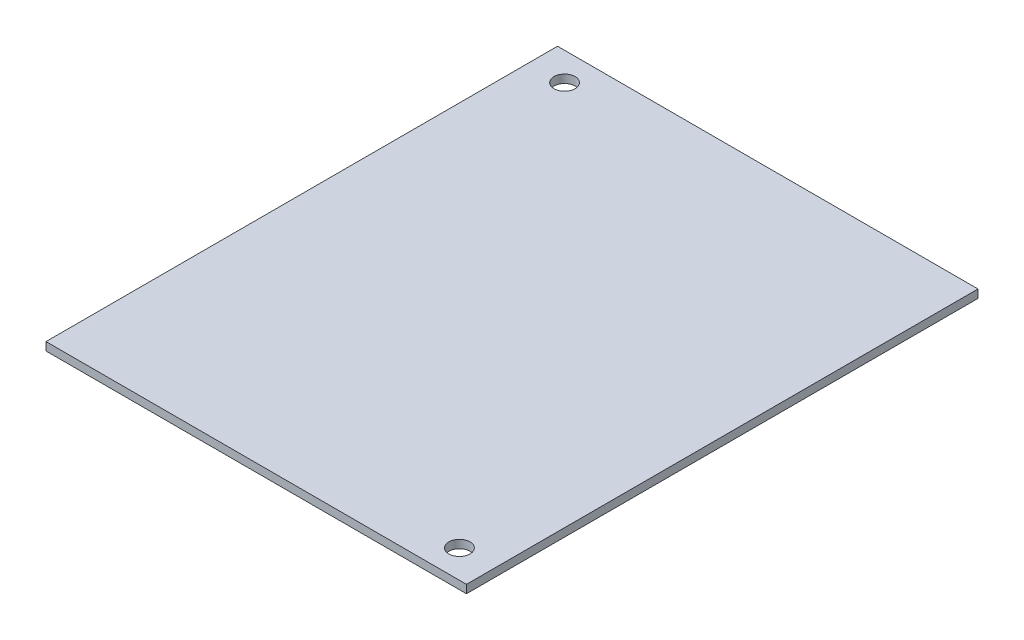
ISO-10303-21;
HEADER;
FILE_DESCRIPTION(('STEP AP214'),'2;1');
FILE_NAME('part.step','',(''),(''),'','','');
FILE_SCHEMA(('AUTOMOTIVE_DESIGN { 1 0 10303 214 1 1 1 1 }'));
ENDSEC;
DATA;
#1=APPLICATION_CONTEXT('core data for automotive mechanical design processes');
#2=APPLICATION_PROTOCOL_DEFINITION('international standard','automotive_design',2000,#1);
#3=PRODUCT_CONTEXT('',#1,'mechanical');
#4=PRODUCT('Part','Part','',(#3));
#5=PRODUCT_RELATED_PRODUCT_CATEGORY('part','',(#4));
#6=PRODUCT_DEFINITION_FORMATION('','',#4);
#7=PRODUCT_DEFINITION_CONTEXT('part definition',#1,'design');
#8=PRODUCT_DEFINITION('design','',#6,#7);
#9=PRODUCT_DEFINITION_SHAPE('','',#8);
#10=(LENGTH_UNIT() NAMED_UNIT(*) SI_UNIT(.MILLI.,.METRE.));
#11=(NAMED_UNIT(*) PLANE_ANGLE_UNIT() SI_UNIT($,.RADIAN.));
#12=(NAMED_UNIT(*) SI_UNIT($,.STERADIAN.) SOLID_ANGLE_UNIT());
#13=UNCERTAINTY_MEASURE_WITH_UNIT(LENGTH_MEASURE(1.E-05),#10,'distance_accuracy_value','');
#14=(GEOMETRIC_REPRESENTATION_CONTEXT(3) GLOBAL_UNCERTAINTY_ASSIGNED_CONTEXT((#13)) GLOBAL_UNIT_ASSIGNED_CONTEXT((#10,
#11,#12)) REPRESENTATION_CONTEXT('',''));
#15=CARTESIAN_POINT('',(0.,0.,0.));
#16=DIRECTION('',(0.,0.,1.));
#17=DIRECTION('',(1.,0.,0.));
#18=AXIS2_PLACEMENT_3D('',#15,#16,#17);
#19=CARTESIAN_POINT('',(0.,1.17,0.));
#20=DIRECTION('',(0.,1.,0.));
#21=DIRECTION('',(0.,0.,1.));
#22=AXIS2_PLACEMENT_3D('',#19,#20,#21);
#23=PLANE('',#22);
#24=CARTESIAN_POINT('',(25.,1.17,32.5));
#25=DIRECTION('',(0.,1.,0.));
#26=DIRECTION('',(0.,0.,1.));
#27=AXIS2_PLACEMENT_3D('',#24,#25,#26);
#28=CIRCLE('',#27,1.5025);
#29=CARTESIAN_POINT('',(25.,1.17,34.0025));
#30=VERTEX_POINT('',#29);
#31=EDGE_CURVE('E101',#30,#30,#28,.T.);
#32=ORIENTED_EDGE('',*,*,#31,.F.);
#33=EDGE_LOOP('',(#32));
#34=FACE_BOUND('',#33,.T.);
#35=DIRECTION('',(0.,0.,1.));
#36=VECTOR('',#35,1.);
#37=CARTESIAN_POINT('',(-30.,1.17,-36.5));
#38=LINE('',#37,#36);
#39=CARTESIAN_POINT('',(-30.,1.17,-36.5));
#40=VERTEX_POINT('',#39);
#41=CARTESIAN_POINT('',(-30.,1.17,36.5));
#42=VERTEX_POINT('',#41);
#43=EDGE_CURVE('E86',#40,#42,#38,.T.);
#44=ORIENTED_EDGE('',*,*,#43,.T.);
#45=DIRECTION('',(1.,0.,0.));
#46=VECTOR('',#45,1.);
#47=CARTESIAN_POINT('',(-30.,1.17,36.5));
#48=LINE('',#47,#46);
#49=CARTESIAN_POINT('',(30.,1.17,36.5));
#50=VERTEX_POINT('',#49);
#51=EDGE_CURVE('E81',#42,#50,#48,.T.);
#52=ORIENTED_EDGE('',*,*,#51,.T.);
#53=DIRECTION('',(0.,0.,-1.));
#54=VECTOR('',#53,1.);
#55=CARTESIAN_POINT('',(30.,1.17,-36.5));
#56=LINE('',#55,#54);
#57=CARTESIAN_POINT('',(30.,1.17,-36.5));
#58=VERTEX_POINT('',#57);
#59=EDGE_CURVE('E84',#50,#58,#56,.T.);
#60=ORIENTED_EDGE('',*,*,#59,.T.);
#61=DIRECTION('',(-1.,0.,0.));
#62=VECTOR('',#61,1.);
#63=CARTESIAN_POINT('',(-30.,1.17,-36.5));
#64=LINE('',#63,#62);
#65=EDGE_CURVE('E51',#58,#40,#64,.T.);
#66=ORIENTED_EDGE('',*,*,#65,.T.);
#67=EDGE_LOOP('',(#44,#52,#60,#66));
#68=FACE_BOUND('',#67,.T.);
#69=CARTESIAN_POINT('',(-25.,1.17,-32.5));
#70=DIRECTION('',(0.,1.,0.));
#71=DIRECTION('',(0.,0.,1.));
#72=AXIS2_PLACEMENT_3D('',#69,#70,#71);
#73=CIRCLE('',#72,1.5025);
#74=CARTESIAN_POINT('',(-25.,1.17,-30.9975));
#75=VERTEX_POINT('',#74);
#76=EDGE_CURVE('E116',#75,#75,#73,.T.);
#77=ORIENTED_EDGE('',*,*,#76,.F.);
#78=EDGE_LOOP('',(#77));
#79=FACE_BOUND('',#78,.T.);
#80=ADVANCED_FACE('F34',(#34,#68,#79),#23,.T.);
#81=CARTESIAN_POINT('',(0.,0.,0.));
#82=DIRECTION('',(0.,1.,0.));
#83=DIRECTION('',(0.,0.,1.));
#84=AXIS2_PLACEMENT_3D('',#81,#82,#83);
#85=PLANE('',#84);
#86=DIRECTION('',(0.,0.,1.));
#87=VECTOR('',#86,1.);
#88=CARTESIAN_POINT('',(-30.,0.,-36.5));
#89=LINE('',#88,#87);
#90=CARTESIAN_POINT('',(-30.,0.,-36.5));
#91=VERTEX_POINT('',#90);
#92=CARTESIAN_POINT('',(-30.,0.,36.5));
#93=VERTEX_POINT('',#92);
#94=EDGE_CURVE('E98',#91,#93,#89,.T.);
#95=ORIENTED_EDGE('',*,*,#94,.F.);
#96=DIRECTION('',(-1.,0.,0.));
#97=VECTOR('',#96,1.);
#98=CARTESIAN_POINT('',(-30.,0.,-36.5));
#99=LINE('',#98,#97);
#100=CARTESIAN_POINT('',(30.,0.,-36.5));
#101=VERTEX_POINT('',#100);
#102=EDGE_CURVE('E74',#101,#91,#99,.T.);
#103=ORIENTED_EDGE('',*,*,#102,.F.);
#104=DIRECTION('',(0.,0.,-1.));
#105=VECTOR('',#104,1.);
#106=CARTESIAN_POINT('',(30.,0.,-36.5));
#107=LINE('',#106,#105);
#108=CARTESIAN_POINT('',(30.,0.,36.5));
#109=VERTEX_POINT('',#108);
#110=EDGE_CURVE('E68',#109,#101,#107,.T.);
#111=ORIENTED_EDGE('',*,*,#110,.F.);
#112=DIRECTION('',(1.,0.,0.));
#113=VECTOR('',#112,1.);
#114=CARTESIAN_POINT('',(-30.,0.,36.5));
#115=LINE('',#114,#113);
#116=EDGE_CURVE('E90',#93,#109,#115,.T.);
#117=ORIENTED_EDGE('',*,*,#116,.F.);
#118=EDGE_LOOP('',(#95,#103,#111,#117));
#119=FACE_BOUND('',#118,.T.);
#120=CARTESIAN_POINT('',(25.,0.,32.5));
#121=DIRECTION('',(0.,1.,0.));
#122=DIRECTION('',(0.,0.,1.));
#123=AXIS2_PLACEMENT_3D('',#120,#121,#122);
#124=CIRCLE('',#123,1.5025);
#125=CARTESIAN_POINT('',(25.,0.,34.0025));
#126=VERTEX_POINT('',#125);
#127=EDGE_CURVE('E113',#126,#126,#124,.T.);
#128=ORIENTED_EDGE('',*,*,#127,.T.);
#129=EDGE_LOOP('',(#128));
#130=FACE_BOUND('',#129,.T.);
#131=CARTESIAN_POINT('',(-25.,0.,-32.5));
#132=DIRECTION('',(0.,1.,0.));
#133=DIRECTION('',(0.,0.,1.));
#134=AXIS2_PLACEMENT_3D('',#131,#132,#133);
#135=CIRCLE('',#134,1.5025);
#136=CARTESIAN_POINT('',(-25.,0.,-30.9975));
#137=VERTEX_POINT('',#136);
#138=EDGE_CURVE('E119',#137,#137,#135,.T.);
#139=ORIENTED_EDGE('',*,*,#138,.T.);
#140=EDGE_LOOP('',(#139));
#141=FACE_BOUND('',#140,.T.);
#142=ADVANCED_FACE('F109',(#119,#130,#141),#85,.F.);
#143=CARTESIAN_POINT('',(-30.,1.17,-36.5));
#144=DIRECTION('',(1.,0.,0.));
#145=DIRECTION('',(0.,0.,-1.));
#146=AXIS2_PLACEMENT_3D('',#143,#144,#145);
#147=PLANE('',#146);
#148=ORIENTED_EDGE('',*,*,#94,.T.);
#149=DIRECTION('',(0.,-1.,0.));
#150=VECTOR('',#149,1.);
#151=CARTESIAN_POINT('',(-30.,1.17,36.5));
#152=LINE('',#151,#150);
#153=EDGE_CURVE('E11',#42,#93,#152,.T.);
#154=ORIENTED_EDGE('',*,*,#153,.F.);
#155=ORIENTED_EDGE('',*,*,#43,.F.);
#156=DIRECTION('',(0.,-1.,0.));
#157=VECTOR('',#156,1.);
#158=CARTESIAN_POINT('',(-30.,1.17,-36.5));
#159=LINE('',#158,#157);
#160=EDGE_CURVE('E94',#40,#91,#159,.T.);
#161=ORIENTED_EDGE('',*,*,#160,.T.);
#162=EDGE_LOOP('',(#148,#154,#155,#161));
#163=FACE_BOUND('',#162,.T.);
#164=ADVANCED_FACE('F36',(#163),#147,.F.);
#165=CARTESIAN_POINT('',(-30.,1.17,36.5));
#166=DIRECTION('',(0.,0.,-1.));
#167=DIRECTION('',(-1.,0.,0.));
#168=AXIS2_PLACEMENT_3D('',#165,#166,#167);
#169=PLANE('',#168);
#170=ORIENTED_EDGE('',*,*,#116,.T.);
#171=DIRECTION('',(0.,-1.,0.));
#172=VECTOR('',#171,1.);
#173=CARTESIAN_POINT('',(30.,1.17,36.5));
#174=LINE('',#173,#172);
#175=EDGE_CURVE('E43',#50,#109,#174,.T.);
#176=ORIENTED_EDGE('',*,*,#175,.F.);
#177=ORIENTED_EDGE('',*,*,#51,.F.);
#178=ORIENTED_EDGE('',*,*,#153,.T.);
#179=EDGE_LOOP('',(#170,#176,#177,#178));
#180=FACE_BOUND('',#179,.T.);
#181=ADVANCED_FACE('F89',(#180),#169,.F.);
#182=CARTESIAN_POINT('',(30.,1.17,-36.5));
#183=DIRECTION('',(-1.,0.,0.));
#184=DIRECTION('',(0.,0.,1.));
#185=AXIS2_PLACEMENT_3D('',#182,#183,#184);
#186=PLANE('',#185);
#187=ORIENTED_EDGE('',*,*,#110,.T.);
#188=DIRECTION('',(0.,-1.,0.));
#189=VECTOR('',#188,1.);
#190=CARTESIAN_POINT('',(30.,1.17,-36.5));
#191=LINE('',#190,#189);
#192=EDGE_CURVE('E91',#58,#101,#191,.T.);
#193=ORIENTED_EDGE('',*,*,#192,.F.);
#194=ORIENTED_EDGE('',*,*,#59,.F.);
#195=ORIENTED_EDGE('',*,*,#175,.T.);
#196=EDGE_LOOP('',(#187,#193,#194,#195));
#197=FACE_BOUND('',#196,.T.);
#198=ADVANCED_FACE('F92',(#197),#186,.F.);
#199=CARTESIAN_POINT('',(-30.,1.17,-36.5));
#200=DIRECTION('',(0.,0.,1.));
#201=DIRECTION('',(1.,0.,0.));
#202=AXIS2_PLACEMENT_3D('',#199,#200,#201);
#203=PLANE('',#202);
#204=ORIENTED_EDGE('',*,*,#102,.T.);
#205=ORIENTED_EDGE('',*,*,#160,.F.);
#206=ORIENTED_EDGE('',*,*,#65,.F.);
#207=ORIENTED_EDGE('',*,*,#192,.T.);
#208=EDGE_LOOP('',(#204,#205,#206,#207));
#209=FACE_BOUND('',#208,.T.);
#210=ADVANCED_FACE('F106',(#209),#203,.F.);
#211=CARTESIAN_POINT('',(25.,1.17,32.5));
#212=DIRECTION('',(0.,-1.,0.));
#213=DIRECTION('',(0.,0.,-1.));
#214=AXIS2_PLACEMENT_3D('',#211,#212,#213);
#215=CYLINDRICAL_SURFACE('',#214,1.5025);
#216=ORIENTED_EDGE('',*,*,#31,.T.);
#217=EDGE_LOOP('',(#216));
#218=FACE_BOUND('',#217,.T.);
#219=ORIENTED_EDGE('',*,*,#127,.F.);
#220=EDGE_LOOP('',(#219));
#221=FACE_BOUND('',#220,.T.);
#222=ADVANCED_FACE('F136',(#218,#221),#215,.F.);
#223=CARTESIAN_POINT('',(-25.,1.17,-32.5));
#224=DIRECTION('',(0.,-1.,0.));
#225=DIRECTION('',(0.,0.,-1.));
#226=AXIS2_PLACEMENT_3D('',#223,#224,#225);
#227=CYLINDRICAL_SURFACE('',#226,1.5025);
#228=ORIENTED_EDGE('',*,*,#76,.T.);
#229=EDGE_LOOP('',(#228));
#230=FACE_BOUND('',#229,.T.);
#231=ORIENTED_EDGE('',*,*,#138,.F.);
#232=EDGE_LOOP('',(#231));
#233=FACE_BOUND('',#232,.T.);
#234=ADVANCED_FACE('F125',(#230,#233),#227,.F.);
#235=CLOSED_SHELL('',(#80,#142,#164,#181,#198,#210,#222,#234));
#236=MANIFOLD_SOLID_BREP('B2',#235);
#237=ADVANCED_BREP_SHAPE_REPRESENTATION('',(#18,#236),#14);
#238=SHAPE_DEFINITION_REPRESENTATION(#9,#237);
ENDSEC;
END-ISO-10303-21;
